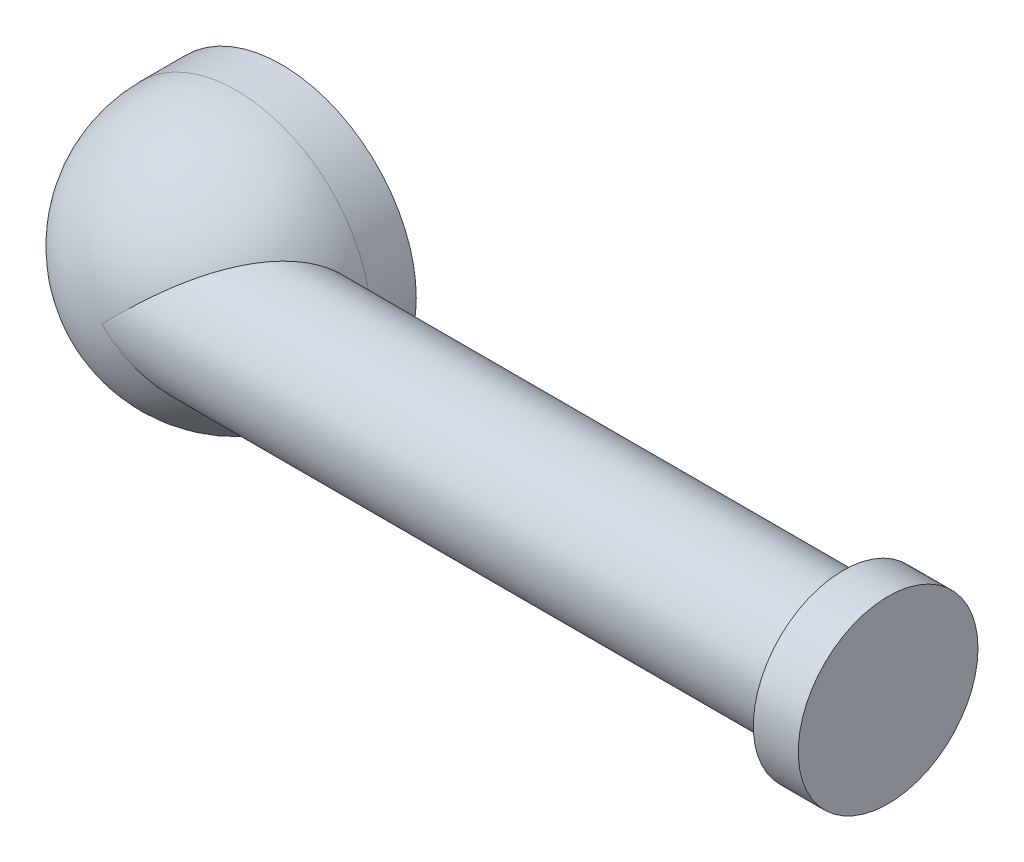
ISO-10303-21;
HEADER;
FILE_DESCRIPTION(('STEP AP214'),'2;1');
FILE_NAME('part.step','',(''),(''),'','','');
FILE_SCHEMA(('AUTOMOTIVE_DESIGN { 1 0 10303 214 1 1 1 1 }'));
ENDSEC;
DATA;
#1=APPLICATION_CONTEXT('core data for automotive mechanical design processes');
#2=APPLICATION_PROTOCOL_DEFINITION('international standard','automotive_design',2000,#1);
#3=PRODUCT_CONTEXT('',#1,'mechanical');
#4=PRODUCT('Part','Part','',(#3));
#5=PRODUCT_RELATED_PRODUCT_CATEGORY('part','',(#4));
#6=PRODUCT_DEFINITION_FORMATION('','',#4);
#7=PRODUCT_DEFINITION_CONTEXT('part definition',#1,'design');
#8=PRODUCT_DEFINITION('design','',#6,#7);
#9=PRODUCT_DEFINITION_SHAPE('','',#8);
#10=(LENGTH_UNIT() NAMED_UNIT(*) SI_UNIT(.MILLI.,.METRE.));
#11=(NAMED_UNIT(*) PLANE_ANGLE_UNIT() SI_UNIT($,.RADIAN.));
#12=(NAMED_UNIT(*) SI_UNIT($,.STERADIAN.) SOLID_ANGLE_UNIT());
#13=UNCERTAINTY_MEASURE_WITH_UNIT(LENGTH_MEASURE(1.E-05),#10,'distance_accuracy_value','');
#14=(GEOMETRIC_REPRESENTATION_CONTEXT(3) GLOBAL_UNCERTAINTY_ASSIGNED_CONTEXT((#13)) GLOBAL_UNIT_ASSIGNED_CONTEXT((#10,
#11,#12)) REPRESENTATION_CONTEXT('',''));
#15=CARTESIAN_POINT('',(0.,0.,0.));
#16=DIRECTION('',(0.,0.,1.));
#17=DIRECTION('',(1.,0.,0.));
#18=AXIS2_PLACEMENT_3D('',#15,#16,#17);
#19=CARTESIAN_POINT('',(16.,0.,2.5));
#20=DIRECTION('',(-1.,0.,0.));
#21=DIRECTION('',(0.,0.,1.));
#22=AXIS2_PLACEMENT_3D('',#19,#20,#21);
#23=CYLINDRICAL_SURFACE('',#22,2.);
#24=CARTESIAN_POINT('',(16.,0.,2.5));
#25=DIRECTION('',(1.,0.,0.));
#26=DIRECTION('',(0.,0.,-1.));
#27=AXIS2_PLACEMENT_3D('',#24,#25,#26);
#28=CIRCLE('',#27,2.);
#29=CARTESIAN_POINT('',(16.,0.,0.5));
#30=VERTEX_POINT('',#29);
#31=EDGE_CURVE('E11',#30,#30,#28,.T.);
#32=ORIENTED_EDGE('',*,*,#31,.F.);
#33=EDGE_LOOP('',(#32));
#34=FACE_BOUND('',#33,.T.);
#35=CARTESIAN_POINT('',(15.,0.,2.5));
#36=DIRECTION('',(1.,0.,0.));
#37=DIRECTION('',(0.,0.,-1.));
#38=AXIS2_PLACEMENT_3D('',#35,#36,#37);
#39=CIRCLE('',#38,2.);
#40=CARTESIAN_POINT('',(15.,0.,0.5));
#41=VERTEX_POINT('',#40);
#42=EDGE_CURVE('E47',#41,#41,#39,.T.);
#43=ORIENTED_EDGE('',*,*,#42,.T.);
#44=EDGE_LOOP('',(#43));
#45=FACE_BOUND('',#44,.T.);
#46=ADVANCED_FACE('F44',(#34,#45),#23,.T.);
#47=CARTESIAN_POINT('',(16.,0.,2.5));
#48=DIRECTION('',(1.,0.,0.));
#49=DIRECTION('',(0.,0.,-1.));
#50=AXIS2_PLACEMENT_3D('',#47,#48,#49);
#51=PLANE('',#50);
#52=ORIENTED_EDGE('',*,*,#31,.T.);
#53=EDGE_LOOP('',(#52));
#54=FACE_BOUND('',#53,.T.);
#55=ADVANCED_FACE('F59',(#54),#51,.T.);
#56=CARTESIAN_POINT('',(15.,0.,2.5));
#57=DIRECTION('',(1.,0.,0.));
#58=DIRECTION('',(0.,0.,-1.));
#59=AXIS2_PLACEMENT_3D('',#56,#57,#58);
#60=PLANE('',#59);
#61=ORIENTED_EDGE('',*,*,#42,.F.);
#62=EDGE_LOOP('',(#61));
#63=FACE_BOUND('',#62,.T.);
#64=ADVANCED_FACE('F57',(#63),#60,.F.);
#65=CLOSED_SHELL('',(#46,#55,#64));
#66=MANIFOLD_SOLID_BREP('B2',#65);
#67=CARTESIAN_POINT('',(0.,0.,1.));
#68=DIRECTION('',(0.,0.,-1.));
#69=DIRECTION('',(1.,0.,0.));
#70=AXIS2_PLACEMENT_3D('',#67,#68,#69);
#71=SPHERICAL_SURFACE('',#70,3.);
#72=CARTESIAN_POINT('',(0.,0.,4.));
#73=CARTESIAN_POINT('',(1.26832105798069E-07,-0.000160049258724782,4.00000000000001));
#74=CARTESIAN_POINT('',(0.000268304739132583,-0.000320098517155357,3.99999997438713));
#75=CARTESIAN_POINT('',(0.000795997257475125,-0.000718775627827621,3.99999984677578));
#76=CARTESIAN_POINT('',(0.000986614918919512,-0.000957403428806713,3.99999971344853));
#77=CARTESIAN_POINT('',(0.0017204219911132,-0.00179357384642934,3.99999904680819));
#78=CARTESIAN_POINT('',(0.00236268284262482,-0.00239111799843097,3.99999821350485));
#79=CARTESIAN_POINT('',(0.00464986330249013,-0.00457443564386771,3.99999386393085));
#80=CARTESIAN_POINT('',(0.00619632482301215,-0.00616019466242874,3.99998818970124));
#81=CARTESIAN_POINT('',(0.0382326374734837,-0.0389428993209798,3.999818881047));
#82=CARTESIAN_POINT('',(0.0699551967988518,-0.0701398841123453,3.99868416197458));
#83=CARTESIAN_POINT('',(0.132116924401084,-0.131821212853352,3.99451012893613));
#84=CARTESIAN_POINT('',(0.162569032760103,-0.162307787137209,3.99150760723361));
#85=CARTESIAN_POINT('',(0.22554717426289,-0.224998862147142,3.98338689665905));
#86=CARTESIAN_POINT('',(0.258082215451881,-0.257189647033718,3.97814657084447));
#87=CARTESIAN_POINT('',(0.323217900591566,-0.321375808359038,3.96553514541372));
#88=CARTESIAN_POINT('',(0.355818005332475,-0.353369297075448,3.95815310293181));
#89=CARTESIAN_POINT('',(0.443638071393206,-0.438978760587499,3.93540980813446));
#90=CARTESIAN_POINT('',(0.498808461178343,-0.492144841908183,3.9180711040993));
#91=CARTESIAN_POINT('',(0.6081018470947,-0.595765758400146,3.87772056576092));
#92=CARTESIAN_POINT('',(0.662228957812349,-0.646247419584737,3.85478806454804));
#93=CARTESIAN_POINT('',(0.773256452790169,-0.747550132677308,3.80177715636595));
#94=CARTESIAN_POINT('',(0.830134546896908,-0.798219389599055,3.77136008825949));
#95=CARTESIAN_POINT('',(0.943560705402561,-0.896203909006726,3.70430744547688));
#96=CARTESIAN_POINT('',(1.00010671925142,-0.943505816942359,3.66764887564311));
#97=CARTESIAN_POINT('',(1.11472625663273,-1.03560251619083,3.58693217142632));
#98=CARTESIAN_POINT('',(1.17277295656304,-1.08022674688465,3.54264059984848));
#99=CARTESIAN_POINT('',(1.28791703805556,-1.16400574747671,3.44819352588891));
#100=CARTESIAN_POINT('',(1.34501534283503,-1.20316614897519,3.39804416062543));
#101=CARTESIAN_POINT('',(1.45397716195538,-1.27260639465357,3.29623220729397));
#102=CARTESIAN_POINT('',(1.50591683130137,-1.30332754652977,3.24495216190576));
#103=CARTESIAN_POINT('',(1.60872816801389,-1.35878743697509,3.13821225960962));
#104=CARTESIAN_POINT('',(1.6595995629145,-1.38352466585498,3.08275135252784));
#105=CARTESIAN_POINT('',(1.75952978463175,-1.42612900486289,2.96884111787433));
#106=CARTESIAN_POINT('',(1.80860230429748,-1.44406787963128,2.91043083369784));
#107=CARTESIAN_POINT('',(1.9052960434755,-1.47284399326374,2.79072901017235));
#108=CARTESIAN_POINT('',(1.95291711502409,-1.48368051039194,2.72943717868087));
#109=CARTESIAN_POINT('',(2.06891784617718,-1.50100442443354,2.57478599834235));
#110=CARTESIAN_POINT('',(2.13632119933061,-1.50292613704129,2.48012214095633));
#111=CARTESIAN_POINT('',(2.26663418852781,-1.48816693855615,2.28887517173171));
#112=CARTESIAN_POINT('',(2.32953628565767,-1.47145556163357,2.19228917104301));
#113=CARTESIAN_POINT('',(2.45000783927216,-1.41786995729972,2.00037050984439));
#114=CARTESIAN_POINT('',(2.50754067178266,-1.38086763673397,1.90504979387047));
#115=CARTESIAN_POINT('',(2.61537217362899,-1.28596868440747,1.72091086957055));
#116=CARTESIAN_POINT('',(2.66567919115289,-1.22809644022743,1.63208521654555));
#117=CARTESIAN_POINT('',(2.75129434707193,-1.10125090180485,1.47732052118705));
#118=CARTESIAN_POINT('',(2.78771014698823,-1.03482457786023,1.4099103766448));
#119=CARTESIAN_POINT('',(2.85282991086221,-0.888184152484829,1.28747426533863));
#120=CARTESIAN_POINT('',(2.88154242087121,-0.80798549354397,1.23243458584289));
#121=CARTESIAN_POINT('',(2.92674835320695,-0.648587940530676,1.14486038054199));
#122=CARTESIAN_POINT('',(2.94439659481524,-0.570857093859021,1.11024219645104));
#123=CARTESIAN_POINT('',(2.97267544614289,-0.409514867927689,1.0544675467237));
#124=CARTESIAN_POINT('',(2.98331116606611,-0.325907820082561,1.03330127873902));
#125=CARTESIAN_POINT('',(2.9965386409156,-0.163830447874826,1.00693154413679));
#126=CARTESIAN_POINT('',(2.99979910731868,-0.0856276210017091,1.00040160172526));
#127=CARTESIAN_POINT('',(3.00018268029668,0.0708441934968566,0.999634822938732));
#128=CARTESIAN_POINT('',(2.99730746910819,0.149113157108092,1.00539461705082));
#129=CARTESIAN_POINT('',(2.98571102813339,0.300715998083658,1.0285203459697));
#130=CARTESIAN_POINT('',(2.97719149748776,0.374127214080527,1.04548578664925));
#131=CARTESIAN_POINT('',(2.95474472851573,0.51683380112906,1.08986965084729));
#132=CARTESIAN_POINT('',(2.94081726428357,0.586129000102777,1.11728851103591));
#133=CARTESIAN_POINT('',(2.90749921893507,0.720576057081828,1.18224389428022));
#134=CARTESIAN_POINT('',(2.88798249893397,0.785583778168306,1.22001303939363));
#135=CARTESIAN_POINT('',(2.84410143094911,0.908162109228617,1.30385593191268));
#136=CARTESIAN_POINT('',(2.8197359105887,0.965730915006776,1.34993168749437));
#137=CARTESIAN_POINT('',(2.76470029341969,1.07641140237698,1.45241429869151));
#138=CARTESIAN_POINT('',(2.73369832713222,1.12888395375788,1.50933172339944));
#139=CARTESIAN_POINT('',(2.66729805318656,1.2235030070076,1.6288746273058));
#140=CARTESIAN_POINT('',(2.63189796064036,1.26564529579208,1.69150242117699));
#141=CARTESIAN_POINT('',(2.55315963849098,1.34343407359404,1.82769661050263));
#142=CARTESIAN_POINT('',(2.50937650276225,1.37785007501472,1.90170736222184));
#143=CARTESIAN_POINT('',(2.41783451073354,1.43380297967775,2.05205790901082));
#144=CARTESIAN_POINT('',(2.3700744531887,1.45533597536447,2.12839840334518));
#145=CARTESIAN_POINT('',(2.26459415295778,1.48807799717098,2.29158317311364));
#146=CARTESIAN_POINT('',(2.20639508148331,1.49752694370003,2.37847033343657));
#147=CARTESIAN_POINT('',(2.08641671822877,1.50162394286499,2.55015747776603));
#148=CARTESIAN_POINT('',(2.0246332671906,1.49625444996993,2.63495486751093));
#149=CARTESIAN_POINT('',(1.88903882716334,1.47024987393027,2.81225385256655));
#150=CARTESIAN_POINT('',(1.81477758314257,1.44752653575537,2.90410484664047));
#151=CARTESIAN_POINT('',(1.66347558266294,1.38663652606466,3.07952097397857));
#152=CARTESIAN_POINT('',(1.58644245791704,1.34850968355538,3.16310678999296));
#153=CARTESIAN_POINT('',(1.41976714078213,1.25316234881541,3.33069457194408));
#154=CARTESIAN_POINT('',(1.32979528451462,1.19409469270134,3.4133161877072));
#155=CARTESIAN_POINT('',(1.14634502248801,1.06135117165502,3.56480558075258));
#156=CARTESIAN_POINT('',(1.05283552414562,0.987487009675092,3.63347034627798));
#157=CARTESIAN_POINT('',(0.904897097431737,0.863244257413484,3.72801634327398));
#158=CARTESIAN_POINT('',(0.85098650533532,0.816456379163705,3.75958534240145));
#159=CARTESIAN_POINT('',(0.742643034536807,0.719933110544932,3.81713880513855));
#160=CARTESIAN_POINT('',(0.688209524750581,0.670193643204449,3.84311530358));
#161=CARTESIAN_POINT('',(0.581810889298889,0.571050055963631,3.88806064627887));
#162=CARTESIAN_POINT('',(0.529862063530551,0.521759135362086,3.90732016837534));
#163=CARTESIAN_POINT('',(0.425993997154682,0.421889406861101,3.94040304767678));
#164=CARTESIAN_POINT('',(0.374075978393518,0.371318526095057,3.95425385296033));
#165=CARTESIAN_POINT('',(0.298120239523781,0.296671509502093,3.97056754391636));
#166=CARTESIAN_POINT('',(0.274121027804152,0.272989364197814,3.97514674625466));
#167=CARTESIAN_POINT('',(0.225720256235712,0.225114586129373,3.98321303039157));
#168=CARTESIAN_POINT('',(0.201317853866168,0.200919498189287,3.98668354358611));
#169=CARTESIAN_POINT('',(0.148076598953859,0.147875425971314,3.99297464808232));
#170=CARTESIAN_POINT('',(0.119260425049868,0.119001273343074,3.99555277288033));
#171=CARTESIAN_POINT('',(0.062497453303157,0.0626639192359225,3.99894218028486));
#172=CARTESIAN_POINT('',(0.0345831119693303,0.0352052333981223,3.99983818756373));
#173=CARTESIAN_POINT('',(0.00619859050430369,0.00616269260105354,3.99998817662347));
#174=CARTESIAN_POINT('',(0.00465478259202641,0.00457942944525603,3.99999384598964));
#175=CARTESIAN_POINT('',(0.00236843303654969,0.00239696219501056,3.99999820482919));
#176=CARTESIAN_POINT('',(0.00172427708809616,0.00179777121038372,3.99999904244031));
#177=CARTESIAN_POINT('',(0.000988688349130935,0.000959346387299766,3.99999971230456));
#178=CARTESIAN_POINT('',(0.000797680018707338,0.000720111210705102,3.9999998462322));
#179=CARTESIAN_POINT('',(0.000268610716348645,0.000320583991857329,3.99999997430935));
#180=CARTESIAN_POINT('',(-1.27024464400882E-07,0.000160291995781113,3.99999999999999));
#181=CARTESIAN_POINT('',(0.,0.,4.));
#182=B_SPLINE_CURVE_WITH_KNOTS('',3,(#72,#73,#74,#75,#76,#77,#78,#79,#80,#81,#82,#83,#84,#85,
#86,#87,#88,#89,#90,#91,#92,#93,#94,#95,#96,#97,#98,#99,#100,#101,#102,#103,#104,#105,#106,#107,
#108,#109,#110,#111,#112,#113,#114,#115,#116,#117,#118,#119,#120,#121,#122,#123,#124,#125,#126,
#127,#128,#129,#130,#131,#132,#133,#134,#135,#136,#137,#138,#139,#140,#141,#142,#143,#144,#145,
#146,#147,#148,#149,#150,#151,#152,#153,#154,#155,#156,#157,#158,#159,#160,#161,#162,#163,#164,
#165,#166,#167,#168,#169,#170,#171,#172,#173,#174,#175,#176,#177,#178,#179,#180,#181),
.UNSPECIFIED.,.T.,.F.,(4,2,2,2,2,2,2,2,2,2,2,2,2,2,2,2,2,2,2,2,2,2,2,2,2,2,2,2,2,2,2,2,2,2,2,2,
2,2,2,2,2,2,2,2,2,2,2,2,2,2,2,2,2,2,4),(0.,0.000679031124020456,0.00169144324775038,
0.00422659780050152,0.0109544740026736,0.14331328236444,0.273144000510812,0.411211408964149,
0.549997069868305,0.785383522551765,1.01760813482303,1.26337143579433,1.51006059566043,
1.76640391421967,2.02248103494377,2.25972492175285,2.49702860075205,2.73175243934914,
2.96650012669719,3.31363002265632,3.66132832293677,4.01124728073204,4.3607586581993,
4.66316964772856,4.96524374119466,5.22452208266795,5.4836112719406,5.71806452327175,
5.95245350213101,6.17888835707079,6.40533267189846,6.63735579059283,6.86943507776023,
7.11858172029027,7.36782980611611,7.64459037435456,7.92143484457975,8.23520468731886,
8.54934620345258,8.90875505349604,9.26724046406695,9.67269496555467,10.0836808208496,
10.3176145126102,10.5518792140381,10.7741505446422,10.995278763261,11.0973551128606,
11.2008923959977,11.3237683251355,11.4402694501649,11.4469867315896,11.4495288742757,
11.450543863204,11.4512239241736),.UNSPECIFIED.);
#183=CARTESIAN_POINT('',(0.,0.,4.));
#184=VERTEX_POINT('',#183);
#185=CARTESIAN_POINT('',(3.,0.,1.));
#186=VERTEX_POINT('',#185);
#187=EDGE_CURVE('E42',#184,#186,#182,.T.);
#188=ORIENTED_EDGE('',*,*,#187,.F.);
#189=EDGE_CURVE('E88',#186,#184,#182,.T.);
#190=ORIENTED_EDGE('',*,*,#189,.F.);
#191=CARTESIAN_POINT('',(0.,0.,1.));
#192=DIRECTION('',(0.,0.,1.));
#193=DIRECTION('',(1.,0.,0.));
#194=AXIS2_PLACEMENT_3D('',#191,#192,#193);
#195=CIRCLE('',#194,3.);
#196=EDGE_CURVE('E106',#186,#186,#195,.T.);
#197=ORIENTED_EDGE('',*,*,#196,.T.);
#198=EDGE_LOOP('',(#188,#190,#197));
#199=FACE_BOUND('',#198,.T.);
#200=ADVANCED_FACE('F84',(#199),#71,.T.);
#201=CARTESIAN_POINT('',(0.,0.,0.));
#202=DIRECTION('',(0.,0.,1.));
#203=DIRECTION('',(1.,0.,0.));
#204=AXIS2_PLACEMENT_3D('',#201,#202,#203);
#205=PLANE('',#204);
#206=CARTESIAN_POINT('',(0.,0.,0.));
#207=DIRECTION('',(0.,0.,1.));
#208=DIRECTION('',(1.,0.,0.));
#209=AXIS2_PLACEMENT_3D('',#206,#207,#208);
#210=CIRCLE('',#209,3.);
#211=CARTESIAN_POINT('',(3.,0.,0.));
#212=VERTEX_POINT('',#211);
#213=EDGE_CURVE('E109',#212,#212,#210,.T.);
#214=ORIENTED_EDGE('',*,*,#213,.F.);
#215=EDGE_LOOP('',(#214));
#216=FACE_BOUND('',#215,.T.);
#217=CARTESIAN_POINT('',(0.,0.,0.));
#218=DIRECTION('',(0.,0.,1.));
#219=DIRECTION('',(1.,0.,0.));
#220=AXIS2_PLACEMENT_3D('',#217,#218,#219);
#221=CIRCLE('',#220,2.);
#222=CARTESIAN_POINT('',(2.,0.,0.));
#223=VERTEX_POINT('',#222);
#224=EDGE_CURVE('E112',#223,#223,#221,.T.);
#225=ORIENTED_EDGE('',*,*,#224,.T.);
#226=EDGE_LOOP('',(#225));
#227=FACE_BOUND('',#226,.T.);
#228=ADVANCED_FACE('F137',(#216,#227),#205,.F.);
#229=CARTESIAN_POINT('',(0.,0.,1.));
#230=DIRECTION('',(0.,0.,-1.));
#231=DIRECTION('',(-1.,0.,0.));
#232=AXIS2_PLACEMENT_3D('',#229,#230,#231);
#233=CYLINDRICAL_SURFACE('',#232,3.);
#234=ORIENTED_EDGE('',*,*,#196,.F.);
#235=EDGE_LOOP('',(#234));
#236=FACE_BOUND('',#235,.T.);
#237=ORIENTED_EDGE('',*,*,#213,.T.);
#238=EDGE_LOOP('',(#237));
#239=FACE_BOUND('',#238,.T.);
#240=ADVANCED_FACE('F86',(#236,#239),#233,.T.);
#241=CARTESIAN_POINT('',(0.,0.,1.));
#242=DIRECTION('',(0.,0.,-1.));
#243=DIRECTION('',(-1.,0.,0.));
#244=AXIS2_PLACEMENT_3D('',#241,#242,#243);
#245=CYLINDRICAL_SURFACE('',#244,2.);
#246=CARTESIAN_POINT('',(0.,0.,1.));
#247=DIRECTION('',(0.,0.,-1.));
#248=DIRECTION('',(-1.,0.,0.));
#249=AXIS2_PLACEMENT_3D('',#246,#247,#248);
#250=CIRCLE('',#249,2.);
#251=CARTESIAN_POINT('',(-2.,0.,1.));
#252=VERTEX_POINT('',#251);
#253=EDGE_CURVE('E116',#252,#252,#250,.T.);
#254=ORIENTED_EDGE('',*,*,#253,.F.);
#255=EDGE_LOOP('',(#254));
#256=FACE_BOUND('',#255,.T.);
#257=ORIENTED_EDGE('',*,*,#224,.F.);
#258=EDGE_LOOP('',(#257));
#259=FACE_BOUND('',#258,.T.);
#260=ADVANCED_FACE('F132',(#256,#259),#245,.F.);
#261=CARTESIAN_POINT('',(0.,0.,1.));
#262=DIRECTION('',(0.,0.,-1.));
#263=DIRECTION('',(-1.,0.,0.));
#264=AXIS2_PLACEMENT_3D('',#261,#262,#263);
#265=PLANE('',#264);
#266=ORIENTED_EDGE('',*,*,#253,.T.);
#267=EDGE_LOOP('',(#266));
#268=FACE_BOUND('',#267,.T.);
#269=ADVANCED_FACE('F126',(#268),#265,.T.);
#270=CARTESIAN_POINT('',(15.,0.,2.5));
#271=DIRECTION('',(-1.,0.,0.));
#272=DIRECTION('',(0.,0.,1.));
#273=AXIS2_PLACEMENT_3D('',#270,#271,#272);
#274=CYLINDRICAL_SURFACE('',#273,1.5);
#275=CARTESIAN_POINT('',(15.,0.,2.5));
#276=DIRECTION('',(1.,0.,0.));
#277=DIRECTION('',(0.,0.,-1.));
#278=AXIS2_PLACEMENT_3D('',#275,#276,#277);
#279=CIRCLE('',#278,1.5);
#280=CARTESIAN_POINT('',(15.,0.,1.));
#281=VERTEX_POINT('',#280);
#282=EDGE_CURVE('E119',#281,#281,#279,.T.);
#283=ORIENTED_EDGE('',*,*,#282,.F.);
#284=EDGE_LOOP('',(#283));
#285=FACE_BOUND('',#284,.T.);
#286=ORIENTED_EDGE('',*,*,#189,.T.);
#287=ORIENTED_EDGE('',*,*,#187,.T.);
#288=EDGE_LOOP('',(#286,#287));
#289=FACE_BOUND('',#288,.T.);
#290=ADVANCED_FACE('F108',(#285,#289),#274,.T.);
#291=CARTESIAN_POINT('',(15.,0.,2.5));
#292=DIRECTION('',(1.,0.,0.));
#293=DIRECTION('',(0.,0.,-1.));
#294=AXIS2_PLACEMENT_3D('',#291,#292,#293);
#295=PLANE('',#294);
#296=ORIENTED_EDGE('',*,*,#282,.T.);
#297=EDGE_LOOP('',(#296));
#298=FACE_BOUND('',#297,.T.);
#299=ADVANCED_FACE('F123',(#298),#295,.T.);
#300=CLOSED_SHELL('',(#200,#228,#240,#260,#269,#290,#299));
#301=MANIFOLD_SOLID_BREP('B6',#300);
#302=ADVANCED_BREP_SHAPE_REPRESENTATION('',(#18,#66,#301),#14);
#303=SHAPE_DEFINITION_REPRESENTATION(#9,#302);
ENDSEC;
END-ISO-10303-21;
